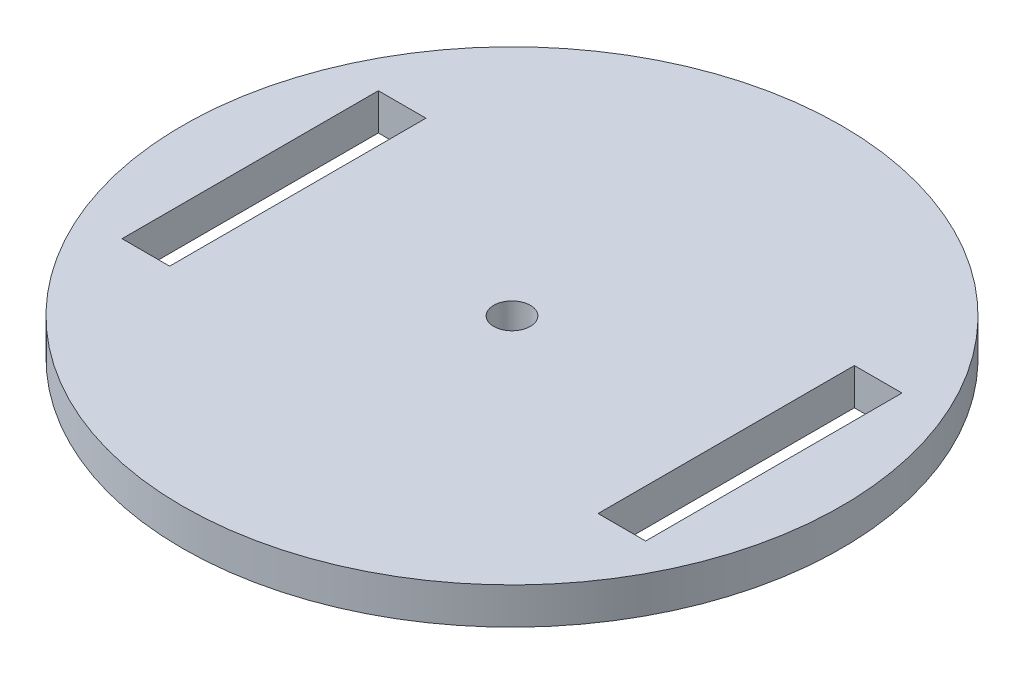
ISO-10303-21;
HEADER;
FILE_DESCRIPTION(('STEP AP214'),'2;1');
FILE_NAME('part.step','',(''),(''),'','','');
FILE_SCHEMA(('AUTOMOTIVE_DESIGN { 1 0 10303 214 1 1 1 1 }'));
ENDSEC;
DATA;
#1=APPLICATION_CONTEXT('core data for automotive mechanical design processes');
#2=APPLICATION_PROTOCOL_DEFINITION('international standard','automotive_design',2000,#1);
#3=PRODUCT_CONTEXT('',#1,'mechanical');
#4=PRODUCT('Part','Part','',(#3));
#5=PRODUCT_RELATED_PRODUCT_CATEGORY('part','',(#4));
#6=PRODUCT_DEFINITION_FORMATION('','',#4);
#7=PRODUCT_DEFINITION_CONTEXT('part definition',#1,'design');
#8=PRODUCT_DEFINITION('design','',#6,#7);
#9=PRODUCT_DEFINITION_SHAPE('','',#8);
#10=(LENGTH_UNIT() NAMED_UNIT(*) SI_UNIT(.MILLI.,.METRE.));
#11=(NAMED_UNIT(*) PLANE_ANGLE_UNIT() SI_UNIT($,.RADIAN.));
#12=(NAMED_UNIT(*) SI_UNIT($,.STERADIAN.) SOLID_ANGLE_UNIT());
#13=UNCERTAINTY_MEASURE_WITH_UNIT(LENGTH_MEASURE(1.E-05),#10,'distance_accuracy_value','');
#14=(GEOMETRIC_REPRESENTATION_CONTEXT(3) GLOBAL_UNCERTAINTY_ASSIGNED_CONTEXT((#13)) GLOBAL_UNIT_ASSIGNED_CONTEXT((#10,
#11,#12)) REPRESENTATION_CONTEXT('',''));
#15=CARTESIAN_POINT('',(0.,0.,0.));
#16=DIRECTION('',(0.,0.,1.));
#17=DIRECTION('',(1.,0.,0.));
#18=AXIS2_PLACEMENT_3D('',#15,#16,#17);
#19=CARTESIAN_POINT('',(0.,10.,-35.));
#20=DIRECTION('',(0.,0.,-1.));
#21=DIRECTION('',(-1.,0.,0.));
#22=AXIS2_PLACEMENT_3D('',#19,#20,#21);
#23=PLANE('',#22);
#24=DIRECTION('',(1.,0.,0.));
#25=VECTOR('',#24,1.);
#26=CARTESIAN_POINT('',(0.,0.,-35.));
#27=LINE('',#26,#25);
#28=CARTESIAN_POINT('',(-71.5,0.,-35.));
#29=VERTEX_POINT('',#28);
#30=CARTESIAN_POINT('',(-58.5,0.,-35.));
#31=VERTEX_POINT('',#30);
#32=EDGE_CURVE('E160',#29,#31,#27,.T.);
#33=ORIENTED_EDGE('',*,*,#32,.T.);
#34=DIRECTION('',(0.,-1.,0.));
#35=VECTOR('',#34,1.);
#36=CARTESIAN_POINT('',(-58.5,10.,-35.));
#37=LINE('',#36,#35);
#38=CARTESIAN_POINT('',(-58.5,10.,-35.));
#39=VERTEX_POINT('',#38);
#40=EDGE_CURVE('E11',#39,#31,#37,.T.);
#41=ORIENTED_EDGE('',*,*,#40,.F.);
#42=DIRECTION('',(1.,0.,0.));
#43=VECTOR('',#42,1.);
#44=CARTESIAN_POINT('',(0.,10.,-35.));
#45=LINE('',#44,#43);
#46=CARTESIAN_POINT('',(-71.5,10.,-35.));
#47=VERTEX_POINT('',#46);
#48=EDGE_CURVE('E119',#47,#39,#45,.T.);
#49=ORIENTED_EDGE('',*,*,#48,.F.);
#50=DIRECTION('',(0.,-1.,0.));
#51=VECTOR('',#50,1.);
#52=CARTESIAN_POINT('',(-71.5,10.,-35.));
#53=LINE('',#52,#51);
#54=EDGE_CURVE('E58',#47,#29,#53,.T.);
#55=ORIENTED_EDGE('',*,*,#54,.T.);
#56=EDGE_LOOP('',(#33,#41,#49,#55));
#57=FACE_BOUND('',#56,.T.);
#58=ADVANCED_FACE('F38',(#57),#23,.F.);
#59=CARTESIAN_POINT('',(-58.5,10.,0.));
#60=DIRECTION('',(1.,0.,0.));
#61=DIRECTION('',(0.,0.,-1.));
#62=AXIS2_PLACEMENT_3D('',#59,#60,#61);
#63=PLANE('',#62);
#64=DIRECTION('',(0.,0.,1.));
#65=VECTOR('',#64,1.);
#66=CARTESIAN_POINT('',(-58.5,0.,0.));
#67=LINE('',#66,#65);
#68=CARTESIAN_POINT('',(-58.5,0.,35.));
#69=VERTEX_POINT('',#68);
#70=EDGE_CURVE('E126',#31,#69,#67,.T.);
#71=ORIENTED_EDGE('',*,*,#70,.T.);
#72=DIRECTION('',(0.,-1.,0.));
#73=VECTOR('',#72,1.);
#74=CARTESIAN_POINT('',(-58.5,10.,35.));
#75=LINE('',#74,#73);
#76=CARTESIAN_POINT('',(-58.5,10.,35.));
#77=VERTEX_POINT('',#76);
#78=EDGE_CURVE('E49',#77,#69,#75,.T.);
#79=ORIENTED_EDGE('',*,*,#78,.F.);
#80=DIRECTION('',(0.,0.,1.));
#81=VECTOR('',#80,1.);
#82=CARTESIAN_POINT('',(-58.5,10.,0.));
#83=LINE('',#82,#81);
#84=EDGE_CURVE('E112',#39,#77,#83,.T.);
#85=ORIENTED_EDGE('',*,*,#84,.F.);
#86=ORIENTED_EDGE('',*,*,#40,.T.);
#87=EDGE_LOOP('',(#71,#79,#85,#86));
#88=FACE_BOUND('',#87,.T.);
#89=ADVANCED_FACE('F125',(#88),#63,.F.);
#90=CARTESIAN_POINT('',(0.,10.,35.));
#91=DIRECTION('',(0.,0.,-1.));
#92=DIRECTION('',(-1.,0.,0.));
#93=AXIS2_PLACEMENT_3D('',#90,#91,#92);
#94=PLANE('',#93);
#95=DIRECTION('',(1.,0.,0.));
#96=VECTOR('',#95,1.);
#97=CARTESIAN_POINT('',(0.,0.,35.));
#98=LINE('',#97,#96);
#99=CARTESIAN_POINT('',(-71.5,0.,35.));
#100=VERTEX_POINT('',#99);
#101=EDGE_CURVE('E165',#100,#69,#98,.T.);
#102=ORIENTED_EDGE('',*,*,#101,.F.);
#103=DIRECTION('',(0.,-1.,0.));
#104=VECTOR('',#103,1.);
#105=CARTESIAN_POINT('',(-71.5,10.,35.));
#106=LINE('',#105,#104);
#107=CARTESIAN_POINT('',(-71.5,10.,35.));
#108=VERTEX_POINT('',#107);
#109=EDGE_CURVE('E84',#108,#100,#106,.T.);
#110=ORIENTED_EDGE('',*,*,#109,.F.);
#111=DIRECTION('',(1.,0.,0.));
#112=VECTOR('',#111,1.);
#113=CARTESIAN_POINT('',(0.,10.,35.));
#114=LINE('',#113,#112);
#115=EDGE_CURVE('E118',#108,#77,#114,.T.);
#116=ORIENTED_EDGE('',*,*,#115,.T.);
#117=ORIENTED_EDGE('',*,*,#78,.T.);
#118=EDGE_LOOP('',(#102,#110,#116,#117));
#119=FACE_BOUND('',#118,.T.);
#120=ADVANCED_FACE('F131',(#119),#94,.T.);
#121=CARTESIAN_POINT('',(0.,10.,-35.));
#122=DIRECTION('',(0.,0.,1.));
#123=DIRECTION('',(1.,0.,0.));
#124=AXIS2_PLACEMENT_3D('',#121,#122,#123);
#125=PLANE('',#124);
#126=DIRECTION('',(-1.,0.,0.));
#127=VECTOR('',#126,1.);
#128=CARTESIAN_POINT('',(0.,0.,-35.));
#129=LINE('',#128,#127);
#130=CARTESIAN_POINT('',(71.5,0.,-35.));
#131=VERTEX_POINT('',#130);
#132=CARTESIAN_POINT('',(58.5,0.,-35.));
#133=VERTEX_POINT('',#132);
#134=EDGE_CURVE('E144',#131,#133,#129,.T.);
#135=ORIENTED_EDGE('',*,*,#134,.F.);
#136=DIRECTION('',(0.,-1.,0.));
#137=VECTOR('',#136,1.);
#138=CARTESIAN_POINT('',(71.5,10.,-35.));
#139=LINE('',#138,#137);
#140=CARTESIAN_POINT('',(71.5,10.,-35.));
#141=VERTEX_POINT('',#140);
#142=EDGE_CURVE('E42',#141,#131,#139,.T.);
#143=ORIENTED_EDGE('',*,*,#142,.F.);
#144=DIRECTION('',(-1.,0.,0.));
#145=VECTOR('',#144,1.);
#146=CARTESIAN_POINT('',(0.,10.,-35.));
#147=LINE('',#146,#145);
#148=CARTESIAN_POINT('',(58.5,10.,-35.));
#149=VERTEX_POINT('',#148);
#150=EDGE_CURVE('E176',#141,#149,#147,.T.);
#151=ORIENTED_EDGE('',*,*,#150,.T.);
#152=DIRECTION('',(0.,-1.,0.));
#153=VECTOR('',#152,1.);
#154=CARTESIAN_POINT('',(58.5,10.,-35.));
#155=LINE('',#154,#153);
#156=EDGE_CURVE('E143',#149,#133,#155,.T.);
#157=ORIENTED_EDGE('',*,*,#156,.T.);
#158=EDGE_LOOP('',(#135,#143,#151,#157));
#159=FACE_BOUND('',#158,.T.);
#160=ADVANCED_FACE('F40',(#159),#125,.T.);
#161=CARTESIAN_POINT('',(71.5,10.,0.));
#162=DIRECTION('',(1.,0.,0.));
#163=DIRECTION('',(0.,0.,-1.));
#164=AXIS2_PLACEMENT_3D('',#161,#162,#163);
#165=PLANE('',#164);
#166=DIRECTION('',(0.,0.,1.));
#167=VECTOR('',#166,1.);
#168=CARTESIAN_POINT('',(71.5,0.,0.));
#169=LINE('',#168,#167);
#170=CARTESIAN_POINT('',(71.5,0.,35.));
#171=VERTEX_POINT('',#170);
#172=EDGE_CURVE('E148',#131,#171,#169,.T.);
#173=ORIENTED_EDGE('',*,*,#172,.T.);
#174=DIRECTION('',(0.,-1.,0.));
#175=VECTOR('',#174,1.);
#176=CARTESIAN_POINT('',(71.5,10.,35.));
#177=LINE('',#176,#175);
#178=CARTESIAN_POINT('',(71.5,10.,35.));
#179=VERTEX_POINT('',#178);
#180=EDGE_CURVE('E185',#179,#171,#177,.T.);
#181=ORIENTED_EDGE('',*,*,#180,.F.);
#182=DIRECTION('',(0.,0.,1.));
#183=VECTOR('',#182,1.);
#184=CARTESIAN_POINT('',(71.5,10.,0.));
#185=LINE('',#184,#183);
#186=EDGE_CURVE('E196',#141,#179,#185,.T.);
#187=ORIENTED_EDGE('',*,*,#186,.F.);
#188=ORIENTED_EDGE('',*,*,#142,.T.);
#189=EDGE_LOOP('',(#173,#181,#187,#188));
#190=FACE_BOUND('',#189,.T.);
#191=ADVANCED_FACE('F195',(#190),#165,.F.);
#192=CARTESIAN_POINT('',(0.,10.,35.));
#193=DIRECTION('',(0.,0.,1.));
#194=DIRECTION('',(1.,0.,0.));
#195=AXIS2_PLACEMENT_3D('',#192,#193,#194);
#196=PLANE('',#195);
#197=DIRECTION('',(-1.,0.,0.));
#198=VECTOR('',#197,1.);
#199=CARTESIAN_POINT('',(0.,0.,35.));
#200=LINE('',#199,#198);
#201=CARTESIAN_POINT('',(58.5,0.,35.));
#202=VERTEX_POINT('',#201);
#203=EDGE_CURVE('E152',#171,#202,#200,.T.);
#204=ORIENTED_EDGE('',*,*,#203,.T.);
#205=DIRECTION('',(0.,-1.,0.));
#206=VECTOR('',#205,1.);
#207=CARTESIAN_POINT('',(58.5,10.,35.));
#208=LINE('',#207,#206);
#209=CARTESIAN_POINT('',(58.5,10.,35.));
#210=VERTEX_POINT('',#209);
#211=EDGE_CURVE('E183',#210,#202,#208,.T.);
#212=ORIENTED_EDGE('',*,*,#211,.F.);
#213=DIRECTION('',(-1.,0.,0.));
#214=VECTOR('',#213,1.);
#215=CARTESIAN_POINT('',(0.,10.,35.));
#216=LINE('',#215,#214);
#217=EDGE_CURVE('E311',#179,#210,#216,.T.);
#218=ORIENTED_EDGE('',*,*,#217,.F.);
#219=ORIENTED_EDGE('',*,*,#180,.T.);
#220=EDGE_LOOP('',(#204,#212,#218,#219));
#221=FACE_BOUND('',#220,.T.);
#222=ADVANCED_FACE('F208',(#221),#196,.F.);
#223=CARTESIAN_POINT('',(-71.5,10.,0.));
#224=DIRECTION('',(1.,0.,0.));
#225=DIRECTION('',(0.,0.,-1.));
#226=AXIS2_PLACEMENT_3D('',#223,#224,#225);
#227=PLANE('',#226);
#228=DIRECTION('',(0.,0.,1.));
#229=VECTOR('',#228,1.);
#230=CARTESIAN_POINT('',(-71.5,0.,0.));
#231=LINE('',#230,#229);
#232=EDGE_CURVE('E168',#29,#100,#231,.T.);
#233=ORIENTED_EDGE('',*,*,#232,.F.);
#234=ORIENTED_EDGE('',*,*,#54,.F.);
#235=DIRECTION('',(0.,0.,1.));
#236=VECTOR('',#235,1.);
#237=CARTESIAN_POINT('',(-71.5,10.,0.));
#238=LINE('',#237,#236);
#239=EDGE_CURVE('E133',#47,#108,#238,.T.);
#240=ORIENTED_EDGE('',*,*,#239,.T.);
#241=ORIENTED_EDGE('',*,*,#109,.T.);
#242=EDGE_LOOP('',(#233,#234,#240,#241));
#243=FACE_BOUND('',#242,.T.);
#244=ADVANCED_FACE('F210',(#243),#227,.T.);
#245=CARTESIAN_POINT('',(58.5,10.,0.));
#246=DIRECTION('',(1.,0.,0.));
#247=DIRECTION('',(0.,0.,-1.));
#248=AXIS2_PLACEMENT_3D('',#245,#246,#247);
#249=PLANE('',#248);
#250=DIRECTION('',(0.,0.,1.));
#251=VECTOR('',#250,1.);
#252=CARTESIAN_POINT('',(58.5,0.,0.));
#253=LINE('',#252,#251);
#254=EDGE_CURVE('E156',#133,#202,#253,.T.);
#255=ORIENTED_EDGE('',*,*,#254,.F.);
#256=ORIENTED_EDGE('',*,*,#156,.F.);
#257=DIRECTION('',(0.,0.,1.));
#258=VECTOR('',#257,1.);
#259=CARTESIAN_POINT('',(58.5,10.,0.));
#260=LINE('',#259,#258);
#261=EDGE_CURVE('E206',#149,#210,#260,.T.);
#262=ORIENTED_EDGE('',*,*,#261,.T.);
#263=ORIENTED_EDGE('',*,*,#211,.T.);
#264=EDGE_LOOP('',(#255,#256,#262,#263));
#265=FACE_BOUND('',#264,.T.);
#266=ADVANCED_FACE('F205',(#265),#249,.T.);
#267=CARTESIAN_POINT('',(0.,10.,0.));
#268=DIRECTION('',(0.,-1.,0.));
#269=DIRECTION('',(0.,0.,-1.));
#270=AXIS2_PLACEMENT_3D('',#267,#268,#269);
#271=CYLINDRICAL_SURFACE('',#270,90.);
#272=CARTESIAN_POINT('',(0.,10.,0.));
#273=DIRECTION('',(0.,1.,0.));
#274=DIRECTION('',(0.,0.,1.));
#275=AXIS2_PLACEMENT_3D('',#272,#273,#274);
#276=CIRCLE('',#275,90.);
#277=CARTESIAN_POINT('',(0.,10.,90.));
#278=VERTEX_POINT('',#277);
#279=EDGE_CURVE('E136',#278,#278,#276,.T.);
#280=ORIENTED_EDGE('',*,*,#279,.F.);
#281=EDGE_LOOP('',(#280));
#282=FACE_BOUND('',#281,.T.);
#283=CARTESIAN_POINT('',(0.,0.,0.));
#284=DIRECTION('',(0.,1.,0.));
#285=DIRECTION('',(0.,0.,1.));
#286=AXIS2_PLACEMENT_3D('',#283,#284,#285);
#287=CIRCLE('',#286,90.);
#288=CARTESIAN_POINT('',(0.,0.,90.));
#289=VERTEX_POINT('',#288);
#290=EDGE_CURVE('E172',#289,#289,#287,.T.);
#291=ORIENTED_EDGE('',*,*,#290,.T.);
#292=EDGE_LOOP('',(#291));
#293=FACE_BOUND('',#292,.T.);
#294=ADVANCED_FACE('F226',(#282,#293),#271,.T.);
#295=CARTESIAN_POINT('',(0.,10.,0.));
#296=DIRECTION('',(0.,1.,0.));
#297=DIRECTION('',(0.,0.,1.));
#298=AXIS2_PLACEMENT_3D('',#295,#296,#297);
#299=PLANE('',#298);
#300=CARTESIAN_POINT('',(0.,10.,0.));
#301=DIRECTION('',(0.,1.,0.));
#302=DIRECTION('',(0.,0.,1.));
#303=AXIS2_PLACEMENT_3D('',#300,#301,#302);
#304=CIRCLE('',#303,5.);
#305=CARTESIAN_POINT('',(0.,10.,5.));
#306=VERTEX_POINT('',#305);
#307=EDGE_CURVE('E299',#306,#306,#304,.F.);
#308=ORIENTED_EDGE('',*,*,#307,.T.);
#309=EDGE_LOOP('',(#308));
#310=FACE_BOUND('',#309,.T.);
#311=ORIENTED_EDGE('',*,*,#150,.F.);
#312=ORIENTED_EDGE('',*,*,#186,.T.);
#313=ORIENTED_EDGE('',*,*,#217,.T.);
#314=ORIENTED_EDGE('',*,*,#261,.F.);
#315=EDGE_LOOP('',(#311,#312,#313,#314));
#316=FACE_BOUND('',#315,.T.);
#317=ORIENTED_EDGE('',*,*,#48,.T.);
#318=ORIENTED_EDGE('',*,*,#84,.T.);
#319=ORIENTED_EDGE('',*,*,#115,.F.);
#320=ORIENTED_EDGE('',*,*,#239,.F.);
#321=EDGE_LOOP('',(#317,#318,#319,#320));
#322=FACE_BOUND('',#321,.T.);
#323=ORIENTED_EDGE('',*,*,#279,.T.);
#324=EDGE_LOOP('',(#323));
#325=FACE_BOUND('',#324,.T.);
#326=ADVANCED_FACE('F114',(#310,#316,#322,#325),#299,.T.);
#327=CARTESIAN_POINT('',(0.,0.,0.));
#328=DIRECTION('',(0.,1.,0.));
#329=DIRECTION('',(0.,0.,1.));
#330=AXIS2_PLACEMENT_3D('',#327,#328,#329);
#331=PLANE('',#330);
#332=CARTESIAN_POINT('',(0.,0.,0.));
#333=DIRECTION('',(0.,-1.,0.));
#334=DIRECTION('',(0.,0.,-1.));
#335=AXIS2_PLACEMENT_3D('',#332,#333,#334);
#336=CIRCLE('',#335,5.);
#337=CARTESIAN_POINT('',(0.,0.,-5.));
#338=VERTEX_POINT('',#337);
#339=EDGE_CURVE('E149',#338,#338,#336,.T.);
#340=ORIENTED_EDGE('',*,*,#339,.F.);
#341=EDGE_LOOP('',(#340));
#342=FACE_BOUND('',#341,.T.);
#343=ORIENTED_EDGE('',*,*,#134,.T.);
#344=ORIENTED_EDGE('',*,*,#254,.T.);
#345=ORIENTED_EDGE('',*,*,#203,.F.);
#346=ORIENTED_EDGE('',*,*,#172,.F.);
#347=EDGE_LOOP('',(#343,#344,#345,#346));
#348=FACE_BOUND('',#347,.T.);
#349=ORIENTED_EDGE('',*,*,#32,.F.);
#350=ORIENTED_EDGE('',*,*,#232,.T.);
#351=ORIENTED_EDGE('',*,*,#101,.T.);
#352=ORIENTED_EDGE('',*,*,#70,.F.);
#353=EDGE_LOOP('',(#349,#350,#351,#352));
#354=FACE_BOUND('',#353,.T.);
#355=ORIENTED_EDGE('',*,*,#290,.F.);
#356=EDGE_LOOP('',(#355));
#357=FACE_BOUND('',#356,.T.);
#358=ADVANCED_FACE('F199',(#342,#348,#354,#357),#331,.F.);
#359=CARTESIAN_POINT('',(0.,10.001,0.));
#360=DIRECTION('',(0.,-1.,0.));
#361=DIRECTION('',(0.,0.,-1.));
#362=AXIS2_PLACEMENT_3D('',#359,#360,#361);
#363=CYLINDRICAL_SURFACE('',#362,5.);
#364=ORIENTED_EDGE('',*,*,#307,.F.);
#365=EDGE_LOOP('',(#364));
#366=FACE_BOUND('',#365,.T.);
#367=ORIENTED_EDGE('',*,*,#339,.T.);
#368=EDGE_LOOP('',(#367));
#369=FACE_BOUND('',#368,.T.);
#370=ADVANCED_FACE('F280',(#366,#369),#363,.F.);
#371=CLOSED_SHELL('',(#58,#89,#120,#160,#191,#222,#244,#266,#294,#326,#358,#370));
#372=MANIFOLD_SOLID_BREP('B2',#371);
#373=ADVANCED_BREP_SHAPE_REPRESENTATION('',(#18,#372),#14);
#374=SHAPE_DEFINITION_REPRESENTATION(#9,#373);
ENDSEC;
END-ISO-10303-21;
